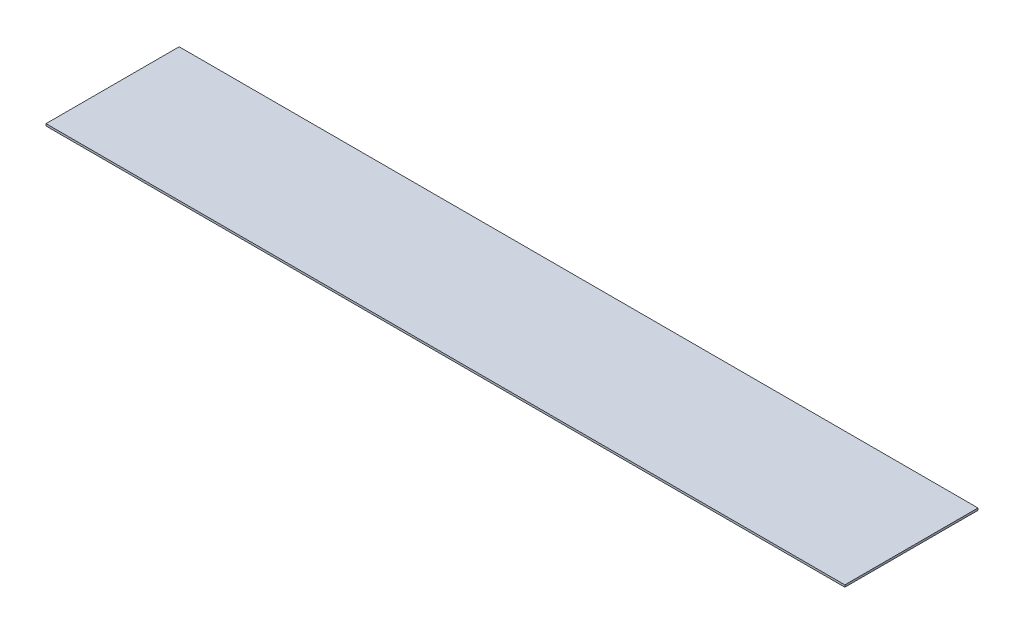
ISO-10303-21;
HEADER;
FILE_DESCRIPTION(('STEP AP214'),'2;1');
FILE_NAME('part.step','',(''),(''),'','','');
FILE_SCHEMA(('AUTOMOTIVE_DESIGN { 1 0 10303 214 1 1 1 1 }'));
ENDSEC;
DATA;
#1=APPLICATION_CONTEXT('core data for automotive mechanical design processes');
#2=APPLICATION_PROTOCOL_DEFINITION('international standard','automotive_design',2000,#1);
#3=PRODUCT_CONTEXT('',#1,'mechanical');
#4=PRODUCT('Part','Part','',(#3));
#5=PRODUCT_RELATED_PRODUCT_CATEGORY('part','',(#4));
#6=PRODUCT_DEFINITION_FORMATION('','',#4);
#7=PRODUCT_DEFINITION_CONTEXT('part definition',#1,'design');
#8=PRODUCT_DEFINITION('design','',#6,#7);
#9=PRODUCT_DEFINITION_SHAPE('','',#8);
#10=(LENGTH_UNIT() NAMED_UNIT(*) SI_UNIT(.MILLI.,.METRE.));
#11=(NAMED_UNIT(*) PLANE_ANGLE_UNIT() SI_UNIT($,.RADIAN.));
#12=(NAMED_UNIT(*) SI_UNIT($,.STERADIAN.) SOLID_ANGLE_UNIT());
#13=UNCERTAINTY_MEASURE_WITH_UNIT(LENGTH_MEASURE(1.E-05),#10,'distance_accuracy_value','');
#14=(GEOMETRIC_REPRESENTATION_CONTEXT(3) GLOBAL_UNCERTAINTY_ASSIGNED_CONTEXT((#13)) GLOBAL_UNIT_ASSIGNED_CONTEXT((#10,
#11,#12)) REPRESENTATION_CONTEXT('',''));
#15=CARTESIAN_POINT('',(0.,0.,0.));
#16=DIRECTION('',(0.,0.,1.));
#17=DIRECTION('',(1.,0.,0.));
#18=AXIS2_PLACEMENT_3D('',#15,#16,#17);
#19=CARTESIAN_POINT('',(0.,-1.5875,0.));
#20=DIRECTION('',(1.,0.,0.));
#21=DIRECTION('',(0.,0.,-1.));
#22=AXIS2_PLACEMENT_3D('',#19,#20,#21);
#23=PLANE('',#22);
#24=DIRECTION('',(0.,0.,-1.));
#25=VECTOR('',#24,1.);
#26=CARTESIAN_POINT('',(0.,0.,0.));
#27=LINE('',#26,#25);
#28=CARTESIAN_POINT('',(0.,0.,101.6));
#29=VERTEX_POINT('',#28);
#30=CARTESIAN_POINT('',(0.,0.,0.));
#31=VERTEX_POINT('',#30);
#32=EDGE_CURVE('E99',#29,#31,#27,.T.);
#33=ORIENTED_EDGE('',*,*,#32,.T.);
#34=DIRECTION('',(0.,1.,0.));
#35=VECTOR('',#34,1.);
#36=CARTESIAN_POINT('',(0.,-1.5875,0.));
#37=LINE('',#36,#35);
#38=CARTESIAN_POINT('',(0.,-1.5875,0.));
#39=VERTEX_POINT('',#38);
#40=EDGE_CURVE('E11',#39,#31,#37,.T.);
#41=ORIENTED_EDGE('',*,*,#40,.F.);
#42=DIRECTION('',(0.,0.,-1.));
#43=VECTOR('',#42,1.);
#44=CARTESIAN_POINT('',(0.,-1.5875,0.));
#45=LINE('',#44,#43);
#46=CARTESIAN_POINT('',(0.,-1.5875,101.6));
#47=VERTEX_POINT('',#46);
#48=EDGE_CURVE('E87',#47,#39,#45,.T.);
#49=ORIENTED_EDGE('',*,*,#48,.F.);
#50=DIRECTION('',(0.,1.,0.));
#51=VECTOR('',#50,1.);
#52=CARTESIAN_POINT('',(0.,-1.5875,101.6));
#53=LINE('',#52,#51);
#54=EDGE_CURVE('E95',#47,#29,#53,.T.);
#55=ORIENTED_EDGE('',*,*,#54,.T.);
#56=EDGE_LOOP('',(#33,#41,#49,#55));
#57=FACE_BOUND('',#56,.T.);
#58=ADVANCED_FACE('F36',(#57),#23,.F.);
#59=CARTESIAN_POINT('',(0.,-1.5875,0.));
#60=DIRECTION('',(0.,0.,1.));
#61=DIRECTION('',(1.,0.,0.));
#62=AXIS2_PLACEMENT_3D('',#59,#60,#61);
#63=PLANE('',#62);
#64=DIRECTION('',(1.,0.,0.));
#65=VECTOR('',#64,1.);
#66=CARTESIAN_POINT('',(0.,0.,0.));
#67=LINE('',#66,#65);
#68=CARTESIAN_POINT('',(609.6,0.,0.));
#69=VERTEX_POINT('',#68);
#70=EDGE_CURVE('E91',#31,#69,#67,.T.);
#71=ORIENTED_EDGE('',*,*,#70,.T.);
#72=DIRECTION('',(0.,1.,0.));
#73=VECTOR('',#72,1.);
#74=CARTESIAN_POINT('',(609.6,-1.5875,0.));
#75=LINE('',#74,#73);
#76=CARTESIAN_POINT('',(609.6,-1.5875,0.));
#77=VERTEX_POINT('',#76);
#78=EDGE_CURVE('E44',#77,#69,#75,.T.);
#79=ORIENTED_EDGE('',*,*,#78,.F.);
#80=DIRECTION('',(1.,0.,0.));
#81=VECTOR('',#80,1.);
#82=CARTESIAN_POINT('',(0.,-1.5875,0.));
#83=LINE('',#82,#81);
#84=EDGE_CURVE('E82',#39,#77,#83,.T.);
#85=ORIENTED_EDGE('',*,*,#84,.F.);
#86=ORIENTED_EDGE('',*,*,#40,.T.);
#87=EDGE_LOOP('',(#71,#79,#85,#86));
#88=FACE_BOUND('',#87,.T.);
#89=ADVANCED_FACE('F90',(#88),#63,.F.);
#90=CARTESIAN_POINT('',(609.6,-1.5875,0.));
#91=DIRECTION('',(-1.,0.,0.));
#92=DIRECTION('',(0.,0.,1.));
#93=AXIS2_PLACEMENT_3D('',#90,#91,#92);
#94=PLANE('',#93);
#95=DIRECTION('',(0.,0.,1.));
#96=VECTOR('',#95,1.);
#97=CARTESIAN_POINT('',(609.6,0.,0.));
#98=LINE('',#97,#96);
#99=CARTESIAN_POINT('',(609.6,0.,101.6));
#100=VERTEX_POINT('',#99);
#101=EDGE_CURVE('E69',#69,#100,#98,.T.);
#102=ORIENTED_EDGE('',*,*,#101,.T.);
#103=DIRECTION('',(0.,1.,0.));
#104=VECTOR('',#103,1.);
#105=CARTESIAN_POINT('',(609.6,-1.5875,101.6));
#106=LINE('',#105,#104);
#107=CARTESIAN_POINT('',(609.6,-1.5875,101.6));
#108=VERTEX_POINT('',#107);
#109=EDGE_CURVE('E92',#108,#100,#106,.T.);
#110=ORIENTED_EDGE('',*,*,#109,.F.);
#111=DIRECTION('',(0.,0.,1.));
#112=VECTOR('',#111,1.);
#113=CARTESIAN_POINT('',(609.6,-1.5875,0.));
#114=LINE('',#113,#112);
#115=EDGE_CURVE('E85',#77,#108,#114,.T.);
#116=ORIENTED_EDGE('',*,*,#115,.F.);
#117=ORIENTED_EDGE('',*,*,#78,.T.);
#118=EDGE_LOOP('',(#102,#110,#116,#117));
#119=FACE_BOUND('',#118,.T.);
#120=ADVANCED_FACE('F93',(#119),#94,.F.);
#121=CARTESIAN_POINT('',(0.,-1.5875,101.6));
#122=DIRECTION('',(0.,0.,-1.));
#123=DIRECTION('',(-1.,0.,0.));
#124=AXIS2_PLACEMENT_3D('',#121,#122,#123);
#125=PLANE('',#124);
#126=DIRECTION('',(-1.,0.,0.));
#127=VECTOR('',#126,1.);
#128=CARTESIAN_POINT('',(0.,0.,101.6));
#129=LINE('',#128,#127);
#130=EDGE_CURVE('E75',#100,#29,#129,.T.);
#131=ORIENTED_EDGE('',*,*,#130,.T.);
#132=ORIENTED_EDGE('',*,*,#54,.F.);
#133=DIRECTION('',(-1.,0.,0.));
#134=VECTOR('',#133,1.);
#135=CARTESIAN_POINT('',(0.,-1.5875,101.6));
#136=LINE('',#135,#134);
#137=EDGE_CURVE('E52',#108,#47,#136,.T.);
#138=ORIENTED_EDGE('',*,*,#137,.F.);
#139=ORIENTED_EDGE('',*,*,#109,.T.);
#140=EDGE_LOOP('',(#131,#132,#138,#139));
#141=FACE_BOUND('',#140,.T.);
#142=ADVANCED_FACE('F106',(#141),#125,.F.);
#143=CARTESIAN_POINT('',(0.,-1.5875,0.));
#144=DIRECTION('',(0.,1.,0.));
#145=DIRECTION('',(0.,0.,1.));
#146=AXIS2_PLACEMENT_3D('',#143,#144,#145);
#147=PLANE('',#146);
#148=ORIENTED_EDGE('',*,*,#48,.T.);
#149=ORIENTED_EDGE('',*,*,#84,.T.);
#150=ORIENTED_EDGE('',*,*,#115,.T.);
#151=ORIENTED_EDGE('',*,*,#137,.T.);
#152=EDGE_LOOP('',(#148,#149,#150,#151));
#153=FACE_BOUND('',#152,.T.);
#154=ADVANCED_FACE('F83',(#153),#147,.F.);
#155=CARTESIAN_POINT('',(0.,0.,0.));
#156=DIRECTION('',(0.,1.,0.));
#157=DIRECTION('',(0.,0.,1.));
#158=AXIS2_PLACEMENT_3D('',#155,#156,#157);
#159=PLANE('',#158);
#160=ORIENTED_EDGE('',*,*,#32,.F.);
#161=ORIENTED_EDGE('',*,*,#130,.F.);
#162=ORIENTED_EDGE('',*,*,#101,.F.);
#163=ORIENTED_EDGE('',*,*,#70,.F.);
#164=EDGE_LOOP('',(#160,#161,#162,#163));
#165=FACE_BOUND('',#164,.T.);
#166=ADVANCED_FACE('F109',(#165),#159,.T.);
#167=CLOSED_SHELL('',(#58,#89,#120,#142,#154,#166));
#168=MANIFOLD_SOLID_BREP('B2',#167);
#169=ADVANCED_BREP_SHAPE_REPRESENTATION('',(#18,#168),#14);
#170=SHAPE_DEFINITION_REPRESENTATION(#9,#169);
ENDSEC;
END-ISO-10303-21;
